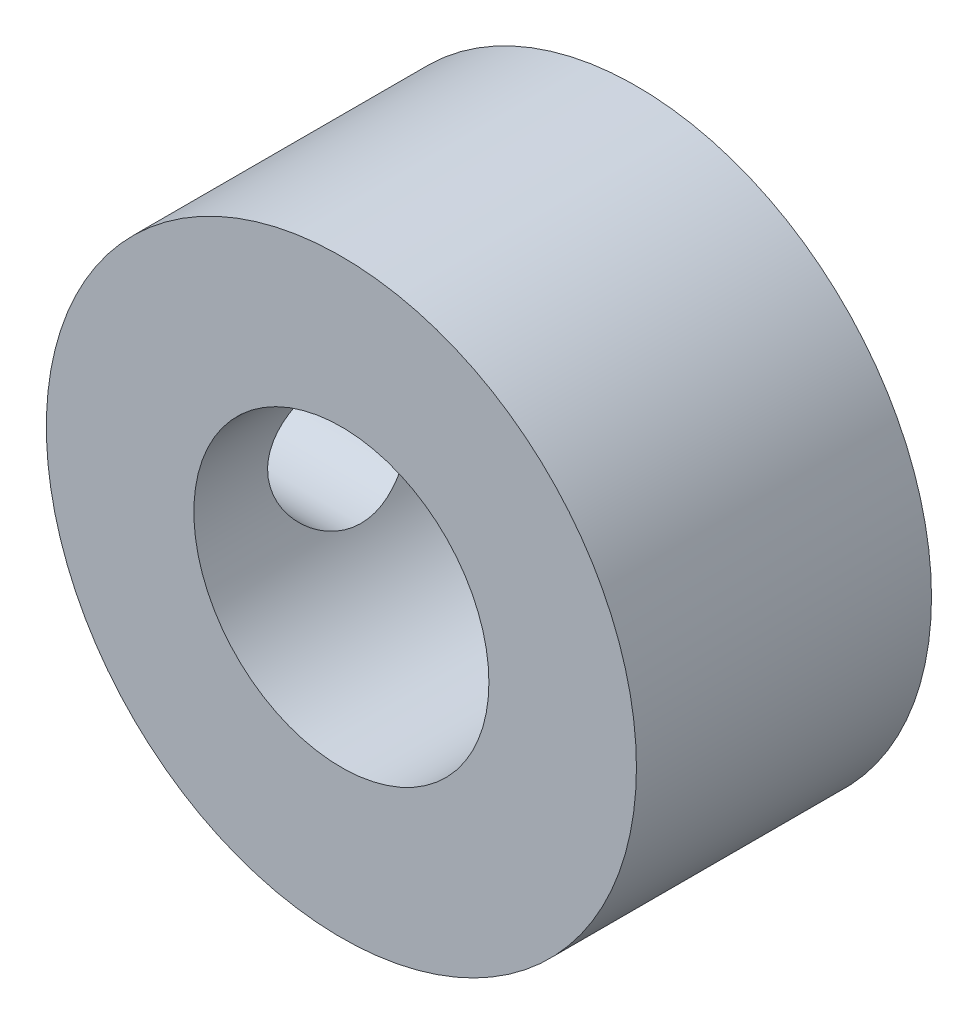
ISO-10303-21;
HEADER;
FILE_DESCRIPTION(('STEP AP214'),'2;1');
FILE_NAME('part.step','',(''),(''),'','','');
FILE_SCHEMA(('AUTOMOTIVE_DESIGN { 1 0 10303 214 1 1 1 1 }'));
ENDSEC;
DATA;
#1=APPLICATION_CONTEXT('core data for automotive mechanical design processes');
#2=APPLICATION_PROTOCOL_DEFINITION('international standard','automotive_design',2000,#1);
#3=PRODUCT_CONTEXT('',#1,'mechanical');
#4=PRODUCT('Part','Part','',(#3));
#5=PRODUCT_RELATED_PRODUCT_CATEGORY('part','',(#4));
#6=PRODUCT_DEFINITION_FORMATION('','',#4);
#7=PRODUCT_DEFINITION_CONTEXT('part definition',#1,'design');
#8=PRODUCT_DEFINITION('design','',#6,#7);
#9=PRODUCT_DEFINITION_SHAPE('','',#8);
#10=(LENGTH_UNIT() NAMED_UNIT(*) SI_UNIT(.MILLI.,.METRE.));
#11=(NAMED_UNIT(*) PLANE_ANGLE_UNIT() SI_UNIT($,.RADIAN.));
#12=(NAMED_UNIT(*) SI_UNIT($,.STERADIAN.) SOLID_ANGLE_UNIT());
#13=UNCERTAINTY_MEASURE_WITH_UNIT(LENGTH_MEASURE(1.E-05),#10,'distance_accuracy_value','');
#14=(GEOMETRIC_REPRESENTATION_CONTEXT(3) GLOBAL_UNCERTAINTY_ASSIGNED_CONTEXT((#13)) GLOBAL_UNIT_ASSIGNED_CONTEXT((#10,
#11,#12)) REPRESENTATION_CONTEXT('',''));
#15=CARTESIAN_POINT('',(0.,0.,0.));
#16=DIRECTION('',(0.,0.,1.));
#17=DIRECTION('',(1.,0.,0.));
#18=AXIS2_PLACEMENT_3D('',#15,#16,#17);
#19=CARTESIAN_POINT('',(0.,0.,5.));
#20=DIRECTION('',(0.,0.,1.));
#21=DIRECTION('',(1.,0.,0.));
#22=AXIS2_PLACEMENT_3D('',#19,#20,#21);
#23=PLANE('',#22);
#24=CARTESIAN_POINT('',(0.,0.,5.));
#25=DIRECTION('',(0.,0.,1.));
#26=DIRECTION('',(1.,0.,0.));
#27=AXIS2_PLACEMENT_3D('',#24,#25,#26);
#28=CIRCLE('',#27,5.);
#29=CARTESIAN_POINT('',(5.,0.,5.));
#30=VERTEX_POINT('',#29);
#31=EDGE_CURVE('E10',#30,#30,#28,.T.);
#32=ORIENTED_EDGE('',*,*,#31,.T.);
#33=EDGE_LOOP('',(#32));
#34=FACE_BOUND('',#33,.T.);
#35=CARTESIAN_POINT('',(0.,0.,5.));
#36=DIRECTION('',(0.,0.,1.));
#37=DIRECTION('',(1.,0.,0.));
#38=AXIS2_PLACEMENT_3D('',#35,#36,#37);
#39=CIRCLE('',#38,2.5);
#40=CARTESIAN_POINT('',(2.5,0.,5.));
#41=VERTEX_POINT('',#40);
#42=EDGE_CURVE('E49',#41,#41,#39,.T.);
#43=ORIENTED_EDGE('',*,*,#42,.F.);
#44=EDGE_LOOP('',(#43));
#45=FACE_BOUND('',#44,.T.);
#46=ADVANCED_FACE('F31',(#34,#45),#23,.T.);
#47=CARTESIAN_POINT('',(0.,0.,0.));
#48=DIRECTION('',(0.,0.,1.));
#49=DIRECTION('',(1.,0.,0.));
#50=AXIS2_PLACEMENT_3D('',#47,#48,#49);
#51=PLANE('',#50);
#52=CARTESIAN_POINT('',(0.,0.,0.));
#53=DIRECTION('',(0.,0.,1.));
#54=DIRECTION('',(1.,0.,0.));
#55=AXIS2_PLACEMENT_3D('',#52,#53,#54);
#56=CIRCLE('',#55,5.);
#57=CARTESIAN_POINT('',(5.,0.,0.));
#58=VERTEX_POINT('',#57);
#59=EDGE_CURVE('E44',#58,#58,#56,.T.);
#60=ORIENTED_EDGE('',*,*,#59,.F.);
#61=EDGE_LOOP('',(#60));
#62=FACE_BOUND('',#61,.T.);
#63=CARTESIAN_POINT('',(0.,0.,0.));
#64=DIRECTION('',(0.,0.,1.));
#65=DIRECTION('',(1.,0.,0.));
#66=AXIS2_PLACEMENT_3D('',#63,#64,#65);
#67=CIRCLE('',#66,2.5);
#68=CARTESIAN_POINT('',(2.5,0.,0.));
#69=VERTEX_POINT('',#68);
#70=EDGE_CURVE('E51',#69,#69,#67,.T.);
#71=ORIENTED_EDGE('',*,*,#70,.T.);
#72=EDGE_LOOP('',(#71));
#73=FACE_BOUND('',#72,.T.);
#74=ADVANCED_FACE('F71',(#62,#73),#51,.F.);
#75=CARTESIAN_POINT('',(0.,0.,5.));
#76=DIRECTION('',(0.,0.,-1.));
#77=DIRECTION('',(-1.,0.,0.));
#78=AXIS2_PLACEMENT_3D('',#75,#76,#77);
#79=CYLINDRICAL_SURFACE('',#78,5.);
#80=CARTESIAN_POINT('',(-5.,0.,1.25));
#81=CARTESIAN_POINT('',(-4.99999883223344,0.0690634072247759,1.25000193811513));
#82=CARTESIAN_POINT('',(-4.99855481776523,0.138148464858969,1.25574295897816));
#83=CARTESIAN_POINT('',(-4.99293428191577,0.27433860314211,1.2785209594225));
#84=CARTESIAN_POINT('',(-4.98875621183307,0.341442539058949,1.29556434128154));
#85=CARTESIAN_POINT('',(-4.97813021943366,0.471684060152148,1.34036604455174));
#86=CARTESIAN_POINT('',(-4.97168502368406,0.534826302858336,1.3681114989294));
#87=CARTESIAN_POINT('',(-4.95721119839661,0.655560109920356,1.43348449170403));
#88=CARTESIAN_POINT('',(-4.94918251545042,0.713151486957299,1.47111236343245));
#89=CARTESIAN_POINT('',(-4.93222844659834,0.822334939417433,1.55600065804518));
#90=CARTESIAN_POINT('',(-4.92328922623777,0.873796408384226,1.60342631246598));
#91=CARTESIAN_POINT('',(-4.90561350097941,0.968124106002753,1.70621017075743));
#92=CARTESIAN_POINT('',(-4.89687701906957,1.01098936412428,1.76156926912208));
#93=CARTESIAN_POINT('',(-4.88045646416425,1.08752211899919,1.87966268894786));
#94=CARTESIAN_POINT('',(-4.87278995392171,1.12104351327113,1.94249435900867));
#95=CARTESIAN_POINT('',(-4.85957912343519,1.17699742379211,2.07312367638197));
#96=CARTESIAN_POINT('',(-4.85403446393991,1.19943171286611,2.14092052777147));
#97=CARTESIAN_POINT('',(-4.84583730597959,1.23212903067024,2.2781195818354));
#98=CARTESIAN_POINT('',(-4.84312909229522,1.24262689027778,2.34746241337483));
#99=CARTESIAN_POINT('',(-4.84074468781451,1.25188481255654,2.48697380751165));
#100=CARTESIAN_POINT('',(-4.8410680037387,1.25064678484831,2.55714223391551));
#101=CARTESIAN_POINT('',(-4.84466004580515,1.2366554371994,2.6945131731204));
#102=CARTESIAN_POINT('',(-4.84785719168233,1.22418195015877,2.76174635122091));
#103=CARTESIAN_POINT('',(-4.85672258063736,1.18852015575259,2.89313420909274));
#104=CARTESIAN_POINT('',(-4.8623909997558,1.16533108505785,2.95728866919082));
#105=CARTESIAN_POINT('',(-4.87562594920155,1.10865789828096,3.08144834687672));
#106=CARTESIAN_POINT('',(-4.88321106224518,1.07507222269409,3.14140514315796));
#107=CARTESIAN_POINT('',(-4.89941425705322,0.998630230012462,3.2549322581307));
#108=CARTESIAN_POINT('',(-4.90803251945613,0.955772290674033,3.30850145672271));
#109=CARTESIAN_POINT('',(-4.92563233783151,0.860552853901015,3.409336346412));
#110=CARTESIAN_POINT('',(-4.93461724564976,0.807955215138216,3.45637874171779));
#111=CARTESIAN_POINT('',(-4.95171637982321,0.695509931253083,3.54101770205325));
#112=CARTESIAN_POINT('',(-4.95983057957846,0.635662064756619,3.57861397855297));
#113=CARTESIAN_POINT('',(-4.97431443411819,0.510096573901159,3.64337548852032));
#114=CARTESIAN_POINT('',(-4.98067800106438,0.444359494340519,3.67050445021202));
#115=CARTESIAN_POINT('',(-4.99089930826182,0.309063340119068,3.71326442142464));
#116=CARTESIAN_POINT('',(-4.99475752782734,0.23950499929207,3.72889763034845));
#117=CARTESIAN_POINT('',(-4.99946249392812,0.100449975325022,3.74788130463236));
#118=CARTESIAN_POINT('',(-5.00038377923565,0.030997266656841,3.75153585506275));
#119=CARTESIAN_POINT('',(-4.99932337345376,-0.107527395667924,3.74729249828709));
#120=CARTESIAN_POINT('',(-4.99734194368205,-0.176599383037163,3.73939563100072));
#121=CARTESIAN_POINT('',(-4.99074650939464,-0.31134522398041,3.71252424300718));
#122=CARTESIAN_POINT('',(-4.98617195154843,-0.377054265807296,3.69371561376918));
#123=CARTESIAN_POINT('',(-4.97490588861778,-0.50438107704376,3.64574409664296));
#124=CARTESIAN_POINT('',(-4.9682141697491,-0.565998432527196,3.61658016307236));
#125=CARTESIAN_POINT('',(-4.95327756605259,-0.684602612024873,3.54813655927106));
#126=CARTESIAN_POINT('',(-4.94500722805777,-0.741487868196526,3.5086865730027));
#127=CARTESIAN_POINT('',(-4.92787090989516,-0.847938844702705,3.42100840933586));
#128=CARTESIAN_POINT('',(-4.91900482709754,-0.897503299144173,3.37277871698591));
#129=CARTESIAN_POINT('',(-4.90140797467309,-0.989158806727275,3.26749836596295));
#130=CARTESIAN_POINT('',(-4.89268586822734,-1.03103655635169,3.21026024749798));
#131=CARTESIAN_POINT('',(-4.87660731981032,-1.10459229917725,3.08938947127857));
#132=CARTESIAN_POINT('',(-4.86925081722522,-1.13627074513161,3.02575709753354));
#133=CARTESIAN_POINT('',(-4.85681745612221,-1.18829285050774,2.89424523132243));
#134=CARTESIAN_POINT('',(-4.85172712743255,-1.20870366387839,2.82639364304666));
#135=CARTESIAN_POINT('',(-4.84438953408486,-1.23778804996148,2.68807530175908));
#136=CARTESIAN_POINT('',(-4.84214164766613,-1.24646418956555,2.61760912413959));
#137=CARTESIAN_POINT('',(-4.84079084336631,-1.25169882527833,2.47823248012066));
#138=CARTESIAN_POINT('',(-4.8415994394022,-1.2485982481501,2.40933547072939));
#139=CARTESIAN_POINT('',(-4.84606590839869,-1.23114773192739,2.27308009277668));
#140=CARTESIAN_POINT('',(-4.84972372409881,-1.21679801890564,2.20572169332196));
#141=CARTESIAN_POINT('',(-4.85942717235602,-1.17744276620233,2.07482628411216));
#142=CARTESIAN_POINT('',(-4.86545846030258,-1.15250117056698,2.01126891229983));
#143=CARTESIAN_POINT('',(-4.87923129770691,-1.09272076133756,1.88919551440526));
#144=CARTESIAN_POINT('',(-4.88697308433977,-1.05788057502849,1.8306801890109));
#145=CARTESIAN_POINT('',(-4.90354695219593,-0.97822312386428,1.71870447583165));
#146=CARTESIAN_POINT('',(-4.91240220693131,-0.933169302426878,1.6654157721467));
#147=CARTESIAN_POINT('',(-4.93006689371905,-0.834824475991446,1.56704412933716));
#148=CARTESIAN_POINT('',(-4.93887631439216,-0.781531517717621,1.52196314157253));
#149=CARTESIAN_POINT('',(-4.95564713039719,-0.667056322252158,1.44049057619616));
#150=CARTESIAN_POINT('',(-4.9635902780489,-0.605748685263656,1.40427115527368));
#151=CARTESIAN_POINT('',(-4.97754104145932,-0.47772171625873,1.34271044754956));
#152=CARTESIAN_POINT('',(-4.98355004333151,-0.41100630286395,1.31736136612622));
#153=CARTESIAN_POINT('',(-4.99206716304618,-0.28700854436956,1.28202347472529));
#154=CARTESIAN_POINT('',(-4.99502154210576,-0.230316809090057,1.27004063078881));
#155=CARTESIAN_POINT('',(-4.9989883769329,-0.11575505961357,1.25402838031505));
#156=CARTESIAN_POINT('',(-5.00000097875745,-0.057885134368847,1.24999837557892));
#157=CARTESIAN_POINT('',(-5.,0.,1.25));
#158=B_SPLINE_CURVE_WITH_KNOTS('',3,(#80,#81,#82,#83,#84,#85,#86,#87,#88,#89,#90,#91,#92,#93,
#94,#95,#96,#97,#98,#99,#100,#101,#102,#103,#104,#105,#106,#107,#108,#109,#110,#111,#112,#113,
#114,#115,#116,#117,#118,#119,#120,#121,#122,#123,#124,#125,#126,#127,#128,#129,#130,#131,#132,
#133,#134,#135,#136,#137,#138,#139,#140,#141,#142,#143,#144,#145,#146,#147,#148,#149,#150,#151,
#152,#153,#154,#155,#156,#157),.UNSPECIFIED.,.T.,.F.,(4,2,2,2,2,2,2,2,2,2,2,2,2,2,2,2,2,2,2,2,2,
2,2,2,2,2,2,2,2,2,2,2,2,2,2,2,2,2,4),(0.,0.206978093726575,0.414073531469916,0.620920751905088,
0.827774950141107,1.03845362864282,1.24915607983385,1.46298872954839,1.6767871764114,
1.88630245916192,2.09578365093914,2.30018747505848,2.50460586221699,2.71108773228233,
2.91760575696802,3.13001250807516,3.34242574631873,3.55556857507595,3.76867061407202,
3.97631924124397,4.18394917593952,4.38850228761698,4.59307606101909,4.80127989637793,
5.00951969173349,5.2228709100373,5.4362126562459,5.6482687884503,5.8602785271034,
6.06619816998844,6.27211367463362,6.47680333799539,6.68152140114084,6.89157980341592,
7.10168808142014,7.3156015458299,7.52936136517791,7.70285202451791,7.87632963369199),.UNSPECIFIED.);
#159=CARTESIAN_POINT('',(-5.,0.,1.25));
#160=VERTEX_POINT('',#159);
#161=EDGE_CURVE('E54',#160,#160,#158,.T.);
#162=ORIENTED_EDGE('',*,*,#161,.T.);
#163=EDGE_LOOP('',(#162));
#164=FACE_BOUND('',#163,.T.);
#165=ORIENTED_EDGE('',*,*,#31,.F.);
#166=EDGE_LOOP('',(#165));
#167=FACE_BOUND('',#166,.T.);
#168=ORIENTED_EDGE('',*,*,#59,.T.);
#169=EDGE_LOOP('',(#168));
#170=FACE_BOUND('',#169,.T.);
#171=ADVANCED_FACE('F33',(#164,#167,#170),#79,.T.);
#172=CARTESIAN_POINT('',(0.,0.,5.));
#173=DIRECTION('',(0.,0.,-1.));
#174=DIRECTION('',(-1.,0.,0.));
#175=AXIS2_PLACEMENT_3D('',#172,#173,#174);
#176=CYLINDRICAL_SURFACE('',#175,2.5);
#177=CARTESIAN_POINT('',(-2.5,0.,3.75));
#178=CARTESIAN_POINT('',(-2.49999641755189,-0.0657149536912331,3.74999587210062));
#179=CARTESIAN_POINT('',(-2.49738113774397,-0.131508249622541,3.74478740859791));
#180=CARTESIAN_POINT('',(-2.48717695046745,-0.261150294085531,3.72418389957385));
#181=CARTESIAN_POINT('',(-2.47957859786229,-0.32499510839188,3.70876950875294));
#182=CARTESIAN_POINT('',(-2.46020349254139,-0.448666931100718,3.66850773922901));
#183=CARTESIAN_POINT('',(-2.448442989719,-0.508508503673975,3.64369701968998));
#184=CARTESIAN_POINT('',(-2.42182220644723,-0.623090771008206,3.58553672329382));
#185=CARTESIAN_POINT('',(-2.40696217041912,-0.677831867487562,3.55218781968893));
#186=CARTESIAN_POINT('',(-2.37445322822571,-0.784384772202399,3.47560343814338));
#187=CARTESIAN_POINT('',(-2.3566899890942,-0.83581901390264,3.43189190095045));
#188=CARTESIAN_POINT('',(-2.3207496280843,-0.930974306083722,3.33684815094121));
#189=CARTESIAN_POINT('',(-2.30257220261294,-0.974689478883458,3.28551018528445));
#190=CARTESIAN_POINT('',(-2.26623688996684,-1.05656500056285,3.17189581309577));
#191=CARTESIAN_POINT('',(-2.24818983712665,-1.09403166943955,3.10907987706761));
#192=CARTESIAN_POINT('',(-2.21607473465401,-1.15771028361337,2.97704083001723));
#193=CARTESIAN_POINT('',(-2.20200384508737,-1.18393026870792,2.90782233909656));
#194=CARTESIAN_POINT('',(-2.18072333797261,-1.22266555273574,2.7691686182226));
#195=CARTESIAN_POINT('',(-2.17315339479642,-1.23590732135055,2.69999443491576));
#196=CARTESIAN_POINT('',(-2.1647736243566,-1.25053374163606,2.56002645277565));
#197=CARTESIAN_POINT('',(-2.1639571167911,-1.25193011046634,2.48923432391106));
#198=CARTESIAN_POINT('',(-2.16888662821561,-1.24335910896537,2.35714246960579));
#199=CARTESIAN_POINT('',(-2.17385954577517,-1.23473069942103,2.29571996097119));
#200=CARTESIAN_POINT('',(-2.18845285917313,-1.20867481132117,2.1753476132837));
#201=CARTESIAN_POINT('',(-2.1980747353972,-1.19124452987206,2.11639856836835));
#202=CARTESIAN_POINT('',(-2.22109345515926,-1.1477622254825,2.00096358429293));
#203=CARTESIAN_POINT('',(-2.23457300829998,-1.12151883389499,1.94456700151776));
#204=CARTESIAN_POINT('',(-2.26379255351755,-1.061302109585,1.83670713426249));
#205=CARTESIAN_POINT('',(-2.27953355975238,-1.02732530476558,1.78524608049989));
#206=CARTESIAN_POINT('',(-2.31391447379107,-0.947582568640986,1.68184843407097));
#207=CARTESIAN_POINT('',(-2.33266887795933,-0.900868072961602,1.6306789080298));
#208=CARTESIAN_POINT('',(-2.36934529125509,-0.799444473426716,1.53658072676137));
#209=CARTESIAN_POINT('',(-2.38726689948501,-0.744731570717856,1.49365600995765));
#210=CARTESIAN_POINT('',(-2.42127484103705,-0.62564563228981,1.41539292371284));
#211=CARTESIAN_POINT('',(-2.43723730202509,-0.56094198949926,1.38049940944282));
#212=CARTESIAN_POINT('',(-2.46447351401553,-0.425582769360996,1.32237871369624));
#213=CARTESIAN_POINT('',(-2.47575098679441,-0.354931970331595,1.29914226873104));
#214=CARTESIAN_POINT('',(-2.49155417176795,-0.215958114575877,1.26690574535416));
#215=CARTESIAN_POINT('',(-2.4965617287664,-0.147926913185405,1.25688595531653));
#216=CARTESIAN_POINT('',(-2.50091266823877,-0.0109744999366919,1.24816908608189));
#217=CARTESIAN_POINT('',(-2.5002587340164,0.0579462748373768,1.24946664295065));
#218=CARTESIAN_POINT('',(-2.49363990316801,0.189041214982492,1.26275836052344));
#219=CARTESIAN_POINT('',(-2.48809057110237,0.251324260062443,1.27391566591254));
#220=CARTESIAN_POINT('',(-2.47277714143524,0.373008615377396,1.30529758986886));
#221=CARTESIAN_POINT('',(-2.46301257917916,0.432409607113746,1.3255232080667));
#222=CARTESIAN_POINT('',(-2.43980314267087,0.548610760562082,1.37499808304147));
#223=CARTESIAN_POINT('',(-2.42626102212424,0.605287996257692,1.40448881264602));
#224=CARTESIAN_POINT('',(-2.39679967896386,0.713076702123651,1.47138441955755));
#225=CARTESIAN_POINT('',(-2.38087944457231,0.764185787219103,1.50879266824179));
#226=CARTESIAN_POINT('',(-2.3463527667183,0.864709611613316,1.59470053166609));
#227=CARTESIAN_POINT('',(-2.32763606060552,0.913465097280799,1.64392858556696));
#228=CARTESIAN_POINT('',(-2.29077989504843,1.00232040139155,1.74990643908663));
#229=CARTESIAN_POINT('',(-2.27264084226908,1.04241423211355,1.80666139852047));
#230=CARTESIAN_POINT('',(-2.23813990282585,1.11463489312212,1.92955456775039));
#231=CARTESIAN_POINT('',(-2.2219066207934,1.1462818698483,1.99601408276074));
#232=CARTESIAN_POINT('',(-2.19467590460158,1.19760353251725,2.13438758461565));
#233=CARTESIAN_POINT('',(-2.18367172800773,1.21729364485946,2.20629440812648));
#234=CARTESIAN_POINT('',(-2.16951876260833,1.2423271093121,2.34613777857681));
#235=CARTESIAN_POINT('',(-2.16571729325614,1.24886624550108,2.41379281678629));
#236=CARTESIAN_POINT('',(-2.16456693307719,1.25086144297598,2.54930883396341));
#237=CARTESIAN_POINT('',(-2.16721524534441,1.2463223082805,2.61716971092429));
#238=CARTESIAN_POINT('',(-2.17797327562531,1.22740765699033,2.74435437691502));
#239=CARTESIAN_POINT('',(-2.18553868102992,1.2140103929285,2.8038755876805));
#240=CARTESIAN_POINT('',(-2.20463770234897,1.17896919778081,2.91976014928088));
#241=CARTESIAN_POINT('',(-2.21617259462095,1.15732261394976,2.97612247761496));
#242=CARTESIAN_POINT('',(-2.2428566295566,1.10476968162585,3.08828106373326));
#243=CARTESIAN_POINT('',(-2.25819652995238,1.07333892227057,3.14378487728713));
#244=CARTESIAN_POINT('',(-2.29044164543238,1.00268871454579,3.24909317022573));
#245=CARTESIAN_POINT('',(-2.30734767243153,0.96346521404831,3.29889466314811));
#246=CARTESIAN_POINT('',(-2.34327903949141,0.872754158330802,3.39767747794702));
#247=CARTESIAN_POINT('',(-2.36231229139336,0.820355528762714,3.4458238779524));
#248=CARTESIAN_POINT('',(-2.3984719031886,0.70769350777535,3.53282872927954));
#249=CARTESIAN_POINT('',(-2.4155972326005,0.647425904070981,3.57168217428286));
#250=CARTESIAN_POINT('',(-2.44622511981379,0.519914496024934,3.63904545345276));
#251=CARTESIAN_POINT('',(-2.45970120703636,0.452624379918268,3.66748021176429));
#252=CARTESIAN_POINT('',(-2.48126676704332,0.313427626617739,3.71226020989869));
#253=CARTESIAN_POINT('',(-2.48937154216165,0.241534749528957,3.72863980853697));
#254=CARTESIAN_POINT('',(-2.49619327387079,0.140752433104229,3.74237176384481));
#255=CARTESIAN_POINT('',(-2.49761706674002,0.112702349299373,3.74522830107952));
#256=CARTESIAN_POINT('',(-2.49952121222331,0.0564396647589468,3.74904333189601));
#257=CARTESIAN_POINT('',(-2.50000153879704,0.0282270595592266,3.750001773089));
#258=CARTESIAN_POINT('',(-2.5,0.,3.75));
#259=B_SPLINE_CURVE_WITH_KNOTS('',3,(#177,#178,#179,#180,#181,#182,#183,#184,#185,#186,#187,
#188,#189,#190,#191,#192,#193,#194,#195,#196,#197,#198,#199,#200,#201,#202,#203,#204,#205,#206,
#207,#208,#209,#210,#211,#212,#213,#214,#215,#216,#217,#218,#219,#220,#221,#222,#223,#224,#225,
#226,#227,#228,#229,#230,#231,#232,#233,#234,#235,#236,#237,#238,#239,#240,#241,#242,#243,#244,
#245,#246,#247,#248,#249,#250,#251,#252,#253,#254,#255,#256,#257,#258),.UNSPECIFIED.,.T.,.F.,(4,
2,2,2,2,2,2,2,2,2,2,2,2,2,2,2,2,2,2,2,2,2,2,2,2,2,2,2,2,2,2,2,2,2,2,2,2,2,2,2,4),(0.,
0.197030321775366,0.394435187136497,0.591077694365373,0.78770470072696,0.996227198397611,
1.20490779706754,1.42977158038441,1.65447434872851,1.86572515175287,2.07676696661275,
2.26257140511651,2.44843504907098,2.63862800210609,2.82890651575277,3.04331176667348,
3.25781918248358,3.48228777768051,3.70657771140349,3.91229113089182,4.11790705639345,
4.30758633132652,4.49728652038664,4.69241070034873,4.88761813435424,5.10199513305523,
5.3165198576929,5.54143352699592,5.76605639925972,5.96911634372967,6.17208824825006,
6.35572412805228,6.53941910979597,6.73545570969517,6.93159451423697,7.15156553440623,
7.37165479220716,7.59330017078656,7.81431135781162,7.89894100172122,7.98357298143558),.UNSPECIFIED.);
#260=CARTESIAN_POINT('',(-2.5,0.,3.75));
#261=VERTEX_POINT('',#260);
#262=EDGE_CURVE('E36',#261,#261,#259,.T.);
#263=ORIENTED_EDGE('',*,*,#262,.F.);
#264=EDGE_LOOP('',(#263));
#265=FACE_BOUND('',#264,.T.);
#266=ORIENTED_EDGE('',*,*,#42,.T.);
#267=EDGE_LOOP('',(#266));
#268=FACE_BOUND('',#267,.T.);
#269=ORIENTED_EDGE('',*,*,#70,.F.);
#270=EDGE_LOOP('',(#269));
#271=FACE_BOUND('',#270,.T.);
#272=ADVANCED_FACE('F63',(#265,#268,#271),#176,.F.);
#273=CARTESIAN_POINT('',(-5.,0.,2.5));
#274=DIRECTION('',(1.,0.,0.));
#275=DIRECTION('',(0.,0.,-1.));
#276=AXIS2_PLACEMENT_3D('',#273,#274,#275);
#277=CYLINDRICAL_SURFACE('',#276,1.25);
#278=ORIENTED_EDGE('',*,*,#262,.T.);
#279=EDGE_LOOP('',(#278));
#280=FACE_BOUND('',#279,.T.);
#281=ORIENTED_EDGE('',*,*,#161,.F.);
#282=EDGE_LOOP('',(#281));
#283=FACE_BOUND('',#282,.T.);
#284=ADVANCED_FACE('F60',(#280,#283),#277,.F.);
#285=CLOSED_SHELL('',(#46,#74,#171,#272,#284));
#286=MANIFOLD_SOLID_BREP('B2',#285);
#287=ADVANCED_BREP_SHAPE_REPRESENTATION('',(#18,#286),#14);
#288=SHAPE_DEFINITION_REPRESENTATION(#9,#287);
ENDSEC;
END-ISO-10303-21;
